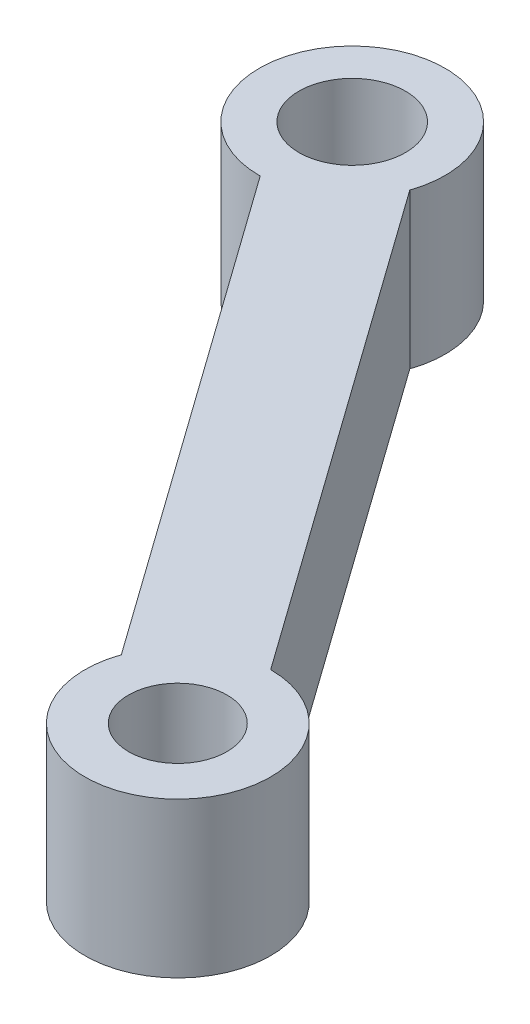
ISO-10303-21;
HEADER;
FILE_DESCRIPTION(('STEP AP214'),'2;1');
FILE_NAME('part.step','',(''),(''),'','','');
FILE_SCHEMA(('AUTOMOTIVE_DESIGN { 1 0 10303 214 1 1 1 1 }'));
ENDSEC;
DATA;
#1=APPLICATION_CONTEXT('core data for automotive mechanical design processes');
#2=APPLICATION_PROTOCOL_DEFINITION('international standard','automotive_design',2000,#1);
#3=PRODUCT_CONTEXT('',#1,'mechanical');
#4=PRODUCT('Part','Part','',(#3));
#5=PRODUCT_RELATED_PRODUCT_CATEGORY('part','',(#4));
#6=PRODUCT_DEFINITION_FORMATION('','',#4);
#7=PRODUCT_DEFINITION_CONTEXT('part definition',#1,'design');
#8=PRODUCT_DEFINITION('design','',#6,#7);
#9=PRODUCT_DEFINITION_SHAPE('','',#8);
#10=(LENGTH_UNIT() NAMED_UNIT(*) SI_UNIT(.MILLI.,.METRE.));
#11=(NAMED_UNIT(*) PLANE_ANGLE_UNIT() SI_UNIT($,.RADIAN.));
#12=(NAMED_UNIT(*) SI_UNIT($,.STERADIAN.) SOLID_ANGLE_UNIT());
#13=UNCERTAINTY_MEASURE_WITH_UNIT(LENGTH_MEASURE(1.E-05),#10,'distance_accuracy_value','');
#14=(GEOMETRIC_REPRESENTATION_CONTEXT(3) GLOBAL_UNCERTAINTY_ASSIGNED_CONTEXT((#13)) GLOBAL_UNIT_ASSIGNED_CONTEXT((#10,
#11,#12)) REPRESENTATION_CONTEXT('',''));
#15=CARTESIAN_POINT('',(0.,0.,0.));
#16=DIRECTION('',(0.,0.,1.));
#17=DIRECTION('',(1.,0.,0.));
#18=AXIS2_PLACEMENT_3D('',#15,#16,#17);
#19=CARTESIAN_POINT('',(52.0873914935222,-5.,-37.1434482684383));
#20=DIRECTION('',(-0.814190348290065,0.,0.580598033712915));
#21=DIRECTION('',(0.580598033712915,0.,0.814190348290065));
#22=AXIS2_PLACEMENT_3D('',#19,#20,#21);
#23=PLANE('',#22);
#24=DIRECTION('',(0.580598033712915,0.,0.814190348290065));
#25=VECTOR('',#24,1.);
#26=CARTESIAN_POINT('',(52.0873914935222,0.,-37.1434482684383));
#27=LINE('',#26,#25);
#28=CARTESIAN_POINT('',(50.028646758475,0.,-40.0304888637175));
#29=VERTEX_POINT('',#28);
#30=CARTESIAN_POINT('',(61.1731588742482,0.,-24.4021992826492));
#31=VERTEX_POINT('',#30);
#32=EDGE_CURVE('E112',#29,#31,#27,.T.);
#33=ORIENTED_EDGE('',*,*,#32,.F.);
#34=DIRECTION('',(0.,1.,0.));
#35=VECTOR('',#34,1.);
#36=CARTESIAN_POINT('',(50.028646758475,-5.,-40.0304888637175));
#37=LINE('',#36,#35);
#38=CARTESIAN_POINT('',(50.028646758475,-5.,-40.0304888637175));
#39=VERTEX_POINT('',#38);
#40=EDGE_CURVE('E11',#39,#29,#37,.T.);
#41=ORIENTED_EDGE('',*,*,#40,.F.);
#42=DIRECTION('',(0.580598033712915,0.,0.814190348290065));
#43=VECTOR('',#42,1.);
#44=CARTESIAN_POINT('',(52.0873914935222,-5.,-37.1434482684383));
#45=LINE('',#44,#43);
#46=CARTESIAN_POINT('',(61.1731588742482,-5.,-24.4021992826492));
#47=VERTEX_POINT('',#46);
#48=EDGE_CURVE('E100',#39,#47,#45,.T.);
#49=ORIENTED_EDGE('',*,*,#48,.T.);
#50=DIRECTION('',(0.,1.,0.));
#51=VECTOR('',#50,1.);
#52=CARTESIAN_POINT('',(61.1731588742482,-5.,-24.4021992826492));
#53=LINE('',#52,#51);
#54=EDGE_CURVE('E44',#47,#31,#53,.T.);
#55=ORIENTED_EDGE('',*,*,#54,.T.);
#56=EDGE_LOOP('',(#33,#41,#49,#55));
#57=FACE_BOUND('',#56,.T.);
#58=ADVANCED_FACE('F41',(#57),#23,.T.);
#59=CARTESIAN_POINT('',(49.9999999999999,-5.,-43.0303520878043));
#60=DIRECTION('',(0.,1.,0.));
#61=DIRECTION('',(0.,0.,1.));
#62=AXIS2_PLACEMENT_3D('',#59,#60,#61);
#63=CYLINDRICAL_SURFACE('',#62,3.);
#64=CARTESIAN_POINT('',(49.9999999999999,0.,-43.0303520878043));
#65=DIRECTION('',(0.,1.,0.));
#66=DIRECTION('',(0.,0.,1.));
#67=AXIS2_PLACEMENT_3D('',#64,#65,#66);
#68=CIRCLE('',#67,3.);
#69=CARTESIAN_POINT('',(52.8363038917113,0.,-42.0529165483122));
#70=VERTEX_POINT('',#69);
#71=EDGE_CURVE('E118',#70,#29,#68,.T.);
#72=ORIENTED_EDGE('',*,*,#71,.F.);
#73=DIRECTION('',(0.,1.,0.));
#74=VECTOR('',#73,1.);
#75=CARTESIAN_POINT('',(52.8363038917113,-5.,-42.0529165483122));
#76=LINE('',#75,#74);
#77=CARTESIAN_POINT('',(52.8363038917113,-5.,-42.0529165483122));
#78=VERTEX_POINT('',#77);
#79=EDGE_CURVE('E50',#78,#70,#76,.T.);
#80=ORIENTED_EDGE('',*,*,#79,.F.);
#81=CARTESIAN_POINT('',(49.9999999999999,-5.,-43.0303520878043));
#82=DIRECTION('',(0.,1.,0.));
#83=DIRECTION('',(0.,0.,1.));
#84=AXIS2_PLACEMENT_3D('',#81,#82,#83);
#85=CIRCLE('',#84,3.);
#86=EDGE_CURVE('E93',#78,#39,#85,.T.);
#87=ORIENTED_EDGE('',*,*,#86,.T.);
#88=ORIENTED_EDGE('',*,*,#40,.T.);
#89=EDGE_LOOP('',(#72,#80,#87,#88));
#90=FACE_BOUND('',#89,.T.);
#91=ADVANCED_FACE('F141',(#90),#63,.T.);
#92=CARTESIAN_POINT('',(54.9046406230162,-5.,-39.152424803838));
#93=DIRECTION('',(-0.814190348290065,0.,0.580598033712915));
#94=DIRECTION('',(0.580598033712915,0.,0.814190348290065));
#95=AXIS2_PLACEMENT_3D('',#92,#93,#94);
#96=PLANE('',#95);
#97=DIRECTION('',(0.580598033712915,0.,0.814190348290065));
#98=VECTOR('',#97,1.);
#99=CARTESIAN_POINT('',(54.9046406230162,0.,-39.152424803838));
#100=LINE('',#99,#98);
#101=CARTESIAN_POINT('',(63.9999999999999,0.,-26.3977246688539));
#102=VERTEX_POINT('',#101);
#103=EDGE_CURVE('E97',#70,#102,#100,.T.);
#104=ORIENTED_EDGE('',*,*,#103,.T.);
#105=DIRECTION('',(0.,1.,0.));
#106=VECTOR('',#105,1.);
#107=CARTESIAN_POINT('',(63.9999999999999,-5.,-26.3977246688539));
#108=LINE('',#107,#106);
#109=CARTESIAN_POINT('',(63.9999999999999,-5.,-26.3977246688539));
#110=VERTEX_POINT('',#109);
#111=EDGE_CURVE('E95',#110,#102,#108,.T.);
#112=ORIENTED_EDGE('',*,*,#111,.F.);
#113=DIRECTION('',(0.580598033712915,0.,0.814190348290065));
#114=VECTOR('',#113,1.);
#115=CARTESIAN_POINT('',(54.9046406230162,-5.,-39.152424803838));
#116=LINE('',#115,#114);
#117=EDGE_CURVE('E88',#78,#110,#116,.T.);
#118=ORIENTED_EDGE('',*,*,#117,.F.);
#119=ORIENTED_EDGE('',*,*,#79,.T.);
#120=EDGE_LOOP('',(#104,#112,#118,#119));
#121=FACE_BOUND('',#120,.T.);
#122=ADVANCED_FACE('F96',(#121),#96,.F.);
#123=CARTESIAN_POINT('',(49.9999999999999,-5.,-43.0303520878043));
#124=DIRECTION('',(0.,1.,0.));
#125=DIRECTION('',(0.,0.,1.));
#126=AXIS2_PLACEMENT_3D('',#123,#124,#125);
#127=CYLINDRICAL_SURFACE('',#126,1.72030782694109);
#128=CARTESIAN_POINT('',(49.9999999999999,-5.,-43.0303520878043));
#129=DIRECTION('',(0.,1.,0.));
#130=DIRECTION('',(0.,0.,1.));
#131=AXIS2_PLACEMENT_3D('',#128,#129,#130);
#132=CIRCLE('',#131,1.72030782694109);
#133=CARTESIAN_POINT('',(49.9999999999999,-5.,-41.3100442608632));
#134=VERTEX_POINT('',#133);
#135=EDGE_CURVE('E106',#134,#134,#132,.T.);
#136=ORIENTED_EDGE('',*,*,#135,.F.);
#137=EDGE_LOOP('',(#136));
#138=FACE_BOUND('',#137,.T.);
#139=CARTESIAN_POINT('',(49.9999999999999,0.,-43.0303520878043));
#140=DIRECTION('',(0.,1.,0.));
#141=DIRECTION('',(0.,0.,1.));
#142=AXIS2_PLACEMENT_3D('',#139,#140,#141);
#143=CIRCLE('',#142,1.72030782694109);
#144=CARTESIAN_POINT('',(49.9999999999999,0.,-41.3100442608632));
#145=VERTEX_POINT('',#144);
#146=EDGE_CURVE('E121',#145,#145,#143,.T.);
#147=ORIENTED_EDGE('',*,*,#146,.T.);
#148=EDGE_LOOP('',(#147));
#149=FACE_BOUND('',#148,.T.);
#150=ADVANCED_FACE('F149',(#138,#149),#127,.F.);
#151=CARTESIAN_POINT('',(63.9999999999998,-5.,-23.3977246688539));
#152=DIRECTION('',(0.,1.,0.));
#153=DIRECTION('',(0.,0.,1.));
#154=AXIS2_PLACEMENT_3D('',#151,#152,#153);
#155=CYLINDRICAL_SURFACE('',#154,3.);
#156=CARTESIAN_POINT('',(63.9999999999998,0.,-23.3977246688539));
#157=DIRECTION('',(0.,1.,0.));
#158=DIRECTION('',(0.,0.,1.));
#159=AXIS2_PLACEMENT_3D('',#156,#157,#158);
#160=CIRCLE('',#159,3.);
#161=EDGE_CURVE('E115',#31,#102,#160,.T.);
#162=ORIENTED_EDGE('',*,*,#161,.F.);
#163=ORIENTED_EDGE('',*,*,#54,.F.);
#164=CARTESIAN_POINT('',(63.9999999999998,-5.,-23.3977246688539));
#165=DIRECTION('',(0.,1.,0.));
#166=DIRECTION('',(0.,0.,1.));
#167=AXIS2_PLACEMENT_3D('',#164,#165,#166);
#168=CIRCLE('',#167,3.);
#169=EDGE_CURVE('E92',#47,#110,#168,.T.);
#170=ORIENTED_EDGE('',*,*,#169,.T.);
#171=ORIENTED_EDGE('',*,*,#111,.T.);
#172=EDGE_LOOP('',(#162,#163,#170,#171));
#173=FACE_BOUND('',#172,.T.);
#174=ADVANCED_FACE('F99',(#173),#155,.T.);
#175=CARTESIAN_POINT('',(63.9999999999998,-5.,-23.3977246688539));
#176=DIRECTION('',(0.,1.,0.));
#177=DIRECTION('',(0.,0.,1.));
#178=AXIS2_PLACEMENT_3D('',#175,#176,#177);
#179=CYLINDRICAL_SURFACE('',#178,1.5875);
#180=CARTESIAN_POINT('',(63.9999999999998,-5.,-23.3977246688539));
#181=DIRECTION('',(0.,1.,0.));
#182=DIRECTION('',(0.,0.,1.));
#183=AXIS2_PLACEMENT_3D('',#180,#181,#182);
#184=CIRCLE('',#183,1.5875);
#185=CARTESIAN_POINT('',(63.9999999999998,-5.,-21.8102246688539));
#186=VERTEX_POINT('',#185);
#187=EDGE_CURVE('E109',#186,#186,#184,.T.);
#188=ORIENTED_EDGE('',*,*,#187,.F.);
#189=EDGE_LOOP('',(#188));
#190=FACE_BOUND('',#189,.T.);
#191=CARTESIAN_POINT('',(63.9999999999998,0.,-23.3977246688539));
#192=DIRECTION('',(0.,1.,0.));
#193=DIRECTION('',(0.,0.,1.));
#194=AXIS2_PLACEMENT_3D('',#191,#192,#193);
#195=CIRCLE('',#194,1.5875);
#196=CARTESIAN_POINT('',(63.9999999999998,0.,-21.8102246688539));
#197=VERTEX_POINT('',#196);
#198=EDGE_CURVE('E102',#197,#197,#195,.T.);
#199=ORIENTED_EDGE('',*,*,#198,.T.);
#200=EDGE_LOOP('',(#199));
#201=FACE_BOUND('',#200,.T.);
#202=ADVANCED_FACE('F128',(#190,#201),#179,.F.);
#203=CARTESIAN_POINT('',(0.,-5.,0.));
#204=DIRECTION('',(0.,1.,0.));
#205=DIRECTION('',(0.,0.,1.));
#206=AXIS2_PLACEMENT_3D('',#203,#204,#205);
#207=PLANE('',#206);
#208=ORIENTED_EDGE('',*,*,#48,.F.);
#209=ORIENTED_EDGE('',*,*,#86,.F.);
#210=ORIENTED_EDGE('',*,*,#117,.T.);
#211=ORIENTED_EDGE('',*,*,#169,.F.);
#212=EDGE_LOOP('',(#208,#209,#210,#211));
#213=FACE_BOUND('',#212,.T.);
#214=ORIENTED_EDGE('',*,*,#135,.T.);
#215=EDGE_LOOP('',(#214));
#216=FACE_BOUND('',#215,.T.);
#217=ORIENTED_EDGE('',*,*,#187,.T.);
#218=EDGE_LOOP('',(#217));
#219=FACE_BOUND('',#218,.T.);
#220=ADVANCED_FACE('F90',(#213,#216,#219),#207,.F.);
#221=CARTESIAN_POINT('',(0.,0.,0.));
#222=DIRECTION('',(0.,1.,0.));
#223=DIRECTION('',(0.,0.,1.));
#224=AXIS2_PLACEMENT_3D('',#221,#222,#223);
#225=PLANE('',#224);
#226=ORIENTED_EDGE('',*,*,#32,.T.);
#227=ORIENTED_EDGE('',*,*,#161,.T.);
#228=ORIENTED_EDGE('',*,*,#103,.F.);
#229=ORIENTED_EDGE('',*,*,#71,.T.);
#230=EDGE_LOOP('',(#226,#227,#228,#229));
#231=FACE_BOUND('',#230,.T.);
#232=ORIENTED_EDGE('',*,*,#146,.F.);
#233=EDGE_LOOP('',(#232));
#234=FACE_BOUND('',#233,.T.);
#235=ORIENTED_EDGE('',*,*,#198,.F.);
#236=EDGE_LOOP('',(#235));
#237=FACE_BOUND('',#236,.T.);
#238=ADVANCED_FACE('F130',(#231,#234,#237),#225,.T.);
#239=CLOSED_SHELL('',(#58,#91,#122,#150,#174,#202,#220,#238));
#240=MANIFOLD_SOLID_BREP('B2',#239);
#241=ADVANCED_BREP_SHAPE_REPRESENTATION('',(#18,#240),#14);
#242=SHAPE_DEFINITION_REPRESENTATION(#9,#241);
ENDSEC;
END-ISO-10303-21;
